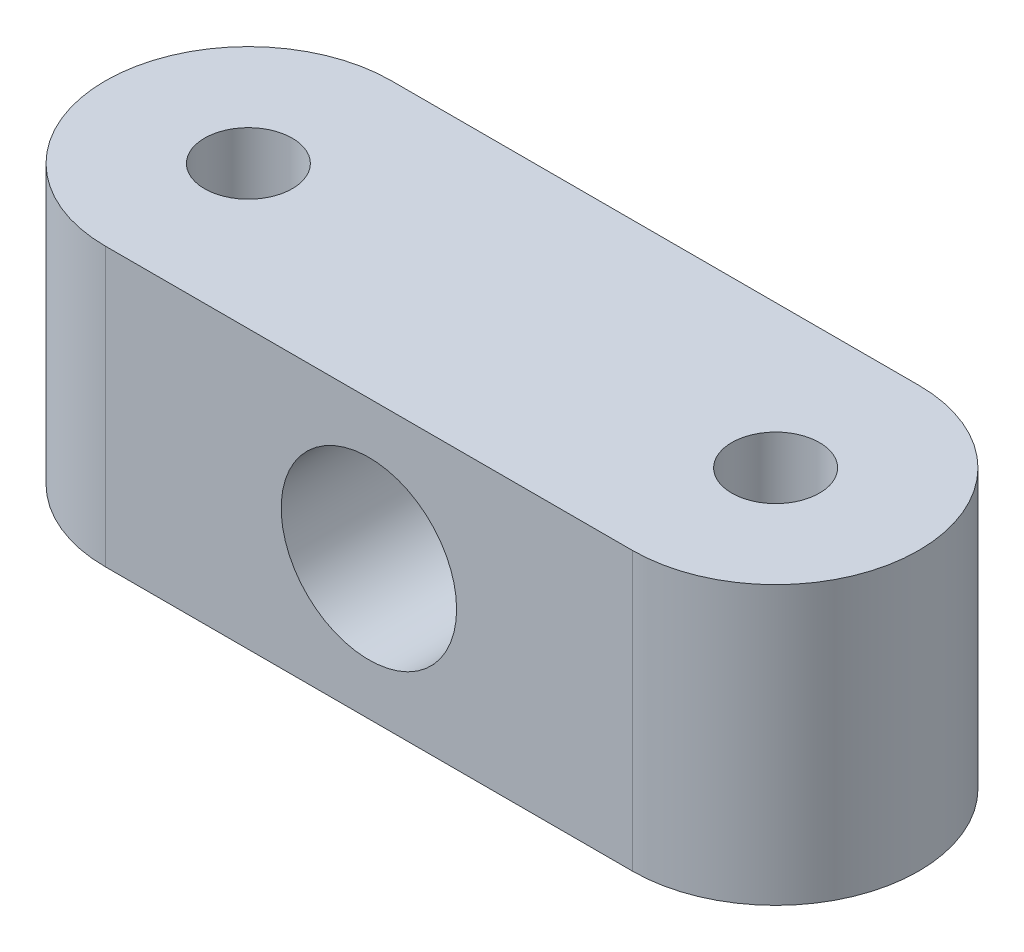
ISO-10303-21;
HEADER;
FILE_DESCRIPTION(('STEP AP214'),'2;1');
FILE_NAME('part.step','',(''),(''),'','','');
FILE_SCHEMA(('AUTOMOTIVE_DESIGN { 1 0 10303 214 1 1 1 1 }'));
ENDSEC;
DATA;
#1=APPLICATION_CONTEXT('core data for automotive mechanical design processes');
#2=APPLICATION_PROTOCOL_DEFINITION('international standard','automotive_design',2000,#1);
#3=PRODUCT_CONTEXT('',#1,'mechanical');
#4=PRODUCT('Part','Part','',(#3));
#5=PRODUCT_RELATED_PRODUCT_CATEGORY('part','',(#4));
#6=PRODUCT_DEFINITION_FORMATION('','',#4);
#7=PRODUCT_DEFINITION_CONTEXT('part definition',#1,'design');
#8=PRODUCT_DEFINITION('design','',#6,#7);
#9=PRODUCT_DEFINITION_SHAPE('','',#8);
#10=(LENGTH_UNIT() NAMED_UNIT(*) SI_UNIT(.MILLI.,.METRE.));
#11=(NAMED_UNIT(*) PLANE_ANGLE_UNIT() SI_UNIT($,.RADIAN.));
#12=(NAMED_UNIT(*) SI_UNIT($,.STERADIAN.) SOLID_ANGLE_UNIT());
#13=UNCERTAINTY_MEASURE_WITH_UNIT(LENGTH_MEASURE(1.E-05),#10,'distance_accuracy_value','');
#14=(GEOMETRIC_REPRESENTATION_CONTEXT(3) GLOBAL_UNCERTAINTY_ASSIGNED_CONTEXT((#13)) GLOBAL_UNIT_ASSIGNED_CONTEXT((#10,
#11,#12)) REPRESENTATION_CONTEXT('',''));
#15=CARTESIAN_POINT('',(0.,0.,0.));
#16=DIRECTION('',(0.,0.,1.));
#17=DIRECTION('',(1.,0.,0.));
#18=AXIS2_PLACEMENT_3D('',#15,#16,#17);
#19=CARTESIAN_POINT('',(0.,38.,0.));
#20=DIRECTION('',(0.,1.,0.));
#21=DIRECTION('',(0.,0.,1.));
#22=AXIS2_PLACEMENT_3D('',#19,#20,#21);
#23=PLANE('',#22);
#24=CARTESIAN_POINT('',(72.1288615325641,38.,0.));
#25=DIRECTION('',(0.,1.,0.));
#26=DIRECTION('',(0.,0.,1.));
#27=AXIS2_PLACEMENT_3D('',#24,#25,#26);
#28=CIRCLE('',#27,6.);
#29=CARTESIAN_POINT('',(72.1288615325641,38.,6.));
#30=VERTEX_POINT('',#29);
#31=EDGE_CURVE('E133',#30,#30,#28,.T.);
#32=ORIENTED_EDGE('',*,*,#31,.F.);
#33=EDGE_LOOP('',(#32));
#34=FACE_BOUND('',#33,.T.);
#35=CARTESIAN_POINT('',(0.,38.,0.));
#36=DIRECTION('',(0.,1.,0.));
#37=DIRECTION('',(0.,0.,1.));
#38=AXIS2_PLACEMENT_3D('',#35,#36,#37);
#39=CIRCLE('',#38,19.5778338445531);
#40=CARTESIAN_POINT('',(0.,38.,-19.5778338445531));
#41=VERTEX_POINT('',#40);
#42=CARTESIAN_POINT('',(0.,38.,19.5778338445531));
#43=VERTEX_POINT('',#42);
#44=EDGE_CURVE('E116',#41,#43,#39,.T.);
#45=ORIENTED_EDGE('',*,*,#44,.T.);
#46=DIRECTION('',(1.,0.,0.));
#47=VECTOR('',#46,1.);
#48=CARTESIAN_POINT('',(0.,38.,19.5778338445531));
#49=LINE('',#48,#47);
#50=CARTESIAN_POINT('',(72.1288615325641,38.,19.5778338445531));
#51=VERTEX_POINT('',#50);
#52=EDGE_CURVE('E109',#43,#51,#49,.T.);
#53=ORIENTED_EDGE('',*,*,#52,.T.);
#54=CARTESIAN_POINT('',(72.1288615325641,38.,0.));
#55=DIRECTION('',(0.,1.,0.));
#56=DIRECTION('',(0.,0.,1.));
#57=AXIS2_PLACEMENT_3D('',#54,#55,#56);
#58=CIRCLE('',#57,19.5778338445531);
#59=CARTESIAN_POINT('',(72.1288615325641,38.,-19.5778338445531));
#60=VERTEX_POINT('',#59);
#61=EDGE_CURVE('E115',#51,#60,#58,.T.);
#62=ORIENTED_EDGE('',*,*,#61,.T.);
#63=DIRECTION('',(1.,0.,0.));
#64=VECTOR('',#63,1.);
#65=CARTESIAN_POINT('',(0.,38.,-19.5778338445531));
#66=LINE('',#65,#64);
#67=EDGE_CURVE('E126',#41,#60,#66,.T.);
#68=ORIENTED_EDGE('',*,*,#67,.F.);
#69=EDGE_LOOP('',(#45,#53,#62,#68));
#70=FACE_BOUND('',#69,.T.);
#71=CARTESIAN_POINT('',(0.,38.,0.));
#72=DIRECTION('',(0.,1.,0.));
#73=DIRECTION('',(0.,0.,1.));
#74=AXIS2_PLACEMENT_3D('',#71,#72,#73);
#75=CIRCLE('',#74,6.);
#76=CARTESIAN_POINT('',(0.,38.,6.));
#77=VERTEX_POINT('',#76);
#78=EDGE_CURVE('E146',#77,#77,#75,.T.);
#79=ORIENTED_EDGE('',*,*,#78,.F.);
#80=EDGE_LOOP('',(#79));
#81=FACE_BOUND('',#80,.T.);
#82=ADVANCED_FACE('F65',(#34,#70,#81),#23,.T.);
#83=CARTESIAN_POINT('',(0.,0.,0.));
#84=DIRECTION('',(0.,1.,0.));
#85=DIRECTION('',(0.,0.,1.));
#86=AXIS2_PLACEMENT_3D('',#83,#84,#85);
#87=PLANE('',#86);
#88=CARTESIAN_POINT('',(72.1288615325641,0.,0.));
#89=DIRECTION('',(0.,1.,0.));
#90=DIRECTION('',(0.,0.,1.));
#91=AXIS2_PLACEMENT_3D('',#88,#89,#90);
#92=CIRCLE('',#91,6.);
#93=CARTESIAN_POINT('',(72.1288615325641,0.,6.));
#94=VERTEX_POINT('',#93);
#95=EDGE_CURVE('E143',#94,#94,#92,.T.);
#96=ORIENTED_EDGE('',*,*,#95,.T.);
#97=EDGE_LOOP('',(#96));
#98=FACE_BOUND('',#97,.T.);
#99=CARTESIAN_POINT('',(0.,0.,0.));
#100=DIRECTION('',(0.,1.,0.));
#101=DIRECTION('',(0.,0.,1.));
#102=AXIS2_PLACEMENT_3D('',#99,#100,#101);
#103=CIRCLE('',#102,19.5778338445531);
#104=CARTESIAN_POINT('',(0.,0.,-19.5778338445531));
#105=VERTEX_POINT('',#104);
#106=CARTESIAN_POINT('',(0.,0.,19.5778338445531));
#107=VERTEX_POINT('',#106);
#108=EDGE_CURVE('E131',#105,#107,#103,.T.);
#109=ORIENTED_EDGE('',*,*,#108,.F.);
#110=DIRECTION('',(1.,0.,0.));
#111=VECTOR('',#110,1.);
#112=CARTESIAN_POINT('',(0.,0.,-19.5778338445531));
#113=LINE('',#112,#111);
#114=CARTESIAN_POINT('',(72.1288615325641,0.,-19.5778338445531));
#115=VERTEX_POINT('',#114);
#116=EDGE_CURVE('E137',#105,#115,#113,.T.);
#117=ORIENTED_EDGE('',*,*,#116,.T.);
#118=CARTESIAN_POINT('',(72.1288615325641,0.,0.));
#119=DIRECTION('',(0.,1.,0.));
#120=DIRECTION('',(0.,0.,1.));
#121=AXIS2_PLACEMENT_3D('',#118,#119,#120);
#122=CIRCLE('',#121,19.5778338445531);
#123=CARTESIAN_POINT('',(72.1288615325641,0.,19.5778338445531));
#124=VERTEX_POINT('',#123);
#125=EDGE_CURVE('E135',#124,#115,#122,.T.);
#126=ORIENTED_EDGE('',*,*,#125,.F.);
#127=DIRECTION('',(1.,0.,0.));
#128=VECTOR('',#127,1.);
#129=CARTESIAN_POINT('',(0.,0.,19.5778338445531));
#130=LINE('',#129,#128);
#131=EDGE_CURVE('E121',#107,#124,#130,.T.);
#132=ORIENTED_EDGE('',*,*,#131,.F.);
#133=EDGE_LOOP('',(#109,#117,#126,#132));
#134=FACE_BOUND('',#133,.T.);
#135=CARTESIAN_POINT('',(0.,0.,0.));
#136=DIRECTION('',(0.,1.,0.));
#137=DIRECTION('',(0.,0.,1.));
#138=AXIS2_PLACEMENT_3D('',#135,#136,#137);
#139=CIRCLE('',#138,6.);
#140=CARTESIAN_POINT('',(0.,0.,6.));
#141=VERTEX_POINT('',#140);
#142=EDGE_CURVE('E149',#141,#141,#139,.T.);
#143=ORIENTED_EDGE('',*,*,#142,.T.);
#144=EDGE_LOOP('',(#143));
#145=FACE_BOUND('',#144,.T.);
#146=ADVANCED_FACE('F177',(#98,#134,#145),#87,.F.);
#147=CARTESIAN_POINT('',(0.,38.,0.));
#148=DIRECTION('',(0.,-1.,0.));
#149=DIRECTION('',(0.,0.,-1.));
#150=AXIS2_PLACEMENT_3D('',#147,#148,#149);
#151=CYLINDRICAL_SURFACE('',#150,19.5778338445531);
#152=ORIENTED_EDGE('',*,*,#108,.T.);
#153=DIRECTION('',(0.,-1.,0.));
#154=VECTOR('',#153,1.);
#155=CARTESIAN_POINT('',(0.,38.,19.5778338445531));
#156=LINE('',#155,#154);
#157=EDGE_CURVE('E12',#43,#107,#156,.T.);
#158=ORIENTED_EDGE('',*,*,#157,.F.);
#159=ORIENTED_EDGE('',*,*,#44,.F.);
#160=DIRECTION('',(0.,-1.,0.));
#161=VECTOR('',#160,1.);
#162=CARTESIAN_POINT('',(0.,38.,-19.5778338445531));
#163=LINE('',#162,#161);
#164=EDGE_CURVE('E83',#41,#105,#163,.T.);
#165=ORIENTED_EDGE('',*,*,#164,.T.);
#166=EDGE_LOOP('',(#152,#158,#159,#165));
#167=FACE_BOUND('',#166,.T.);
#168=ADVANCED_FACE('F67',(#167),#151,.T.);
#169=CARTESIAN_POINT('',(0.,38.,19.5778338445531));
#170=DIRECTION('',(0.,0.,-1.));
#171=DIRECTION('',(-1.,0.,0.));
#172=AXIS2_PLACEMENT_3D('',#169,#170,#171);
#173=PLANE('',#172);
#174=CARTESIAN_POINT('',(36.064430766282,19.,19.5778338445531));
#175=DIRECTION('',(0.,0.,1.));
#176=DIRECTION('',(1.,0.,0.));
#177=AXIS2_PLACEMENT_3D('',#174,#175,#176);
#178=CIRCLE('',#177,12.);
#179=CARTESIAN_POINT('',(48.064430766282,19.,19.5778338445531));
#180=VERTEX_POINT('',#179);
#181=EDGE_CURVE('E154',#180,#180,#178,.T.);
#182=ORIENTED_EDGE('',*,*,#181,.F.);
#183=EDGE_LOOP('',(#182));
#184=FACE_BOUND('',#183,.T.);
#185=ORIENTED_EDGE('',*,*,#131,.T.);
#186=DIRECTION('',(0.,-1.,0.));
#187=VECTOR('',#186,1.);
#188=CARTESIAN_POINT('',(72.1288615325641,38.,19.5778338445531));
#189=LINE('',#188,#187);
#190=EDGE_CURVE('E75',#51,#124,#189,.T.);
#191=ORIENTED_EDGE('',*,*,#190,.F.);
#192=ORIENTED_EDGE('',*,*,#52,.F.);
#193=ORIENTED_EDGE('',*,*,#157,.T.);
#194=EDGE_LOOP('',(#185,#191,#192,#193));
#195=FACE_BOUND('',#194,.T.);
#196=ADVANCED_FACE('F120',(#184,#195),#173,.F.);
#197=CARTESIAN_POINT('',(72.1288615325641,38.,0.));
#198=DIRECTION('',(0.,-1.,0.));
#199=DIRECTION('',(0.,0.,-1.));
#200=AXIS2_PLACEMENT_3D('',#197,#198,#199);
#201=CYLINDRICAL_SURFACE('',#200,19.5778338445531);
#202=ORIENTED_EDGE('',*,*,#125,.T.);
#203=DIRECTION('',(0.,-1.,0.));
#204=VECTOR('',#203,1.);
#205=CARTESIAN_POINT('',(72.1288615325641,38.,-19.5778338445531));
#206=LINE('',#205,#204);
#207=EDGE_CURVE('E98',#60,#115,#206,.T.);
#208=ORIENTED_EDGE('',*,*,#207,.F.);
#209=ORIENTED_EDGE('',*,*,#61,.F.);
#210=ORIENTED_EDGE('',*,*,#190,.T.);
#211=EDGE_LOOP('',(#202,#208,#209,#210));
#212=FACE_BOUND('',#211,.T.);
#213=ADVANCED_FACE('F125',(#212),#201,.T.);
#214=CARTESIAN_POINT('',(0.,38.,-19.5778338445531));
#215=DIRECTION('',(0.,0.,-1.));
#216=DIRECTION('',(-1.,0.,0.));
#217=AXIS2_PLACEMENT_3D('',#214,#215,#216);
#218=PLANE('',#217);
#219=CARTESIAN_POINT('',(36.064430766282,19.,-19.5778338445531));
#220=DIRECTION('',(0.,0.,-1.));
#221=DIRECTION('',(-1.,0.,0.));
#222=AXIS2_PLACEMENT_3D('',#219,#220,#221);
#223=CIRCLE('',#222,12.);
#224=CARTESIAN_POINT('',(24.064430766282,19.,-19.5778338445531));
#225=VERTEX_POINT('',#224);
#226=EDGE_CURVE('E69',#225,#225,#223,.T.);
#227=ORIENTED_EDGE('',*,*,#226,.F.);
#228=EDGE_LOOP('',(#227));
#229=FACE_BOUND('',#228,.T.);
#230=ORIENTED_EDGE('',*,*,#116,.F.);
#231=ORIENTED_EDGE('',*,*,#164,.F.);
#232=ORIENTED_EDGE('',*,*,#67,.T.);
#233=ORIENTED_EDGE('',*,*,#207,.T.);
#234=EDGE_LOOP('',(#230,#231,#232,#233));
#235=FACE_BOUND('',#234,.T.);
#236=ADVANCED_FACE('F163',(#229,#235),#218,.T.);
#237=CARTESIAN_POINT('',(72.1288615325641,38.,0.));
#238=DIRECTION('',(0.,-1.,0.));
#239=DIRECTION('',(0.,0.,-1.));
#240=AXIS2_PLACEMENT_3D('',#237,#238,#239);
#241=CYLINDRICAL_SURFACE('',#240,6.);
#242=ORIENTED_EDGE('',*,*,#31,.T.);
#243=EDGE_LOOP('',(#242));
#244=FACE_BOUND('',#243,.T.);
#245=ORIENTED_EDGE('',*,*,#95,.F.);
#246=EDGE_LOOP('',(#245));
#247=FACE_BOUND('',#246,.T.);
#248=ADVANCED_FACE('F165',(#244,#247),#241,.F.);
#249=CARTESIAN_POINT('',(0.,38.,0.));
#250=DIRECTION('',(0.,-1.,0.));
#251=DIRECTION('',(0.,0.,-1.));
#252=AXIS2_PLACEMENT_3D('',#249,#250,#251);
#253=CYLINDRICAL_SURFACE('',#252,6.);
#254=ORIENTED_EDGE('',*,*,#78,.T.);
#255=EDGE_LOOP('',(#254));
#256=FACE_BOUND('',#255,.T.);
#257=ORIENTED_EDGE('',*,*,#142,.F.);
#258=EDGE_LOOP('',(#257));
#259=FACE_BOUND('',#258,.T.);
#260=ADVANCED_FACE('F171',(#256,#259),#253,.F.);
#261=CARTESIAN_POINT('',(36.064430766282,19.,-78.4221661554469));
#262=DIRECTION('',(0.,0.,1.));
#263=DIRECTION('',(1.,0.,0.));
#264=AXIS2_PLACEMENT_3D('',#261,#262,#263);
#265=CYLINDRICAL_SURFACE('',#264,12.);
#266=ORIENTED_EDGE('',*,*,#226,.T.);
#267=EDGE_LOOP('',(#266));
#268=FACE_BOUND('',#267,.T.);
#269=ORIENTED_EDGE('',*,*,#181,.T.);
#270=EDGE_LOOP('',(#269));
#271=FACE_BOUND('',#270,.T.);
#272=ADVANCED_FACE('F161',(#268,#271),#265,.F.);
#273=CLOSED_SHELL('',(#82,#146,#168,#196,#213,#236,#248,#260,#272));
#274=MANIFOLD_SOLID_BREP('B2',#273);
#275=ADVANCED_BREP_SHAPE_REPRESENTATION('',(#18,#274),#14);
#276=SHAPE_DEFINITION_REPRESENTATION(#9,#275);
ENDSEC;
END-ISO-10303-21;
